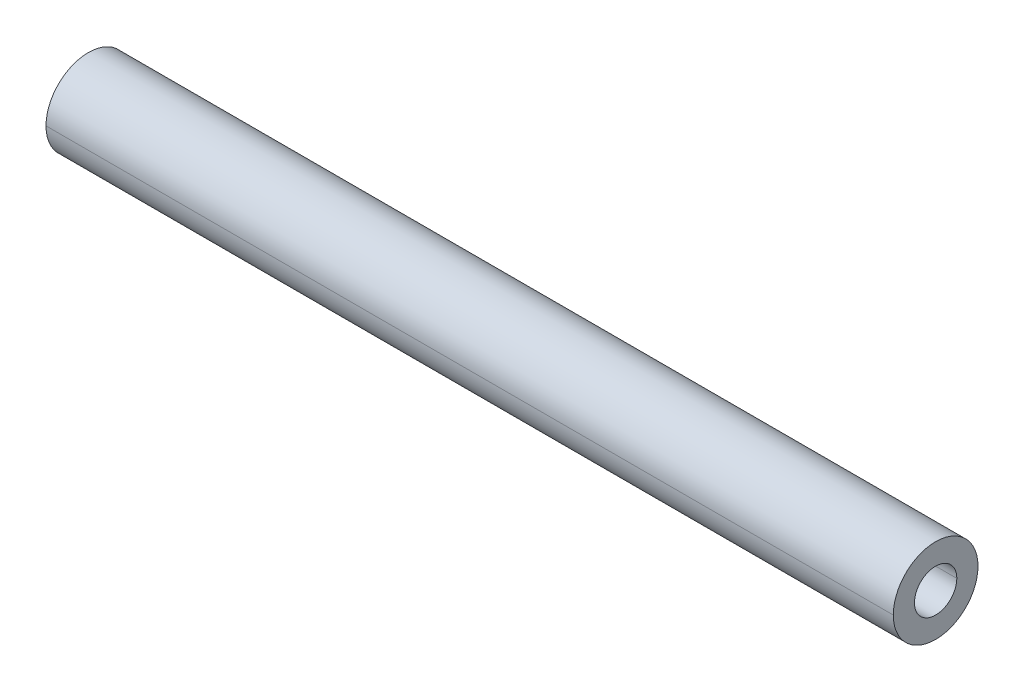
ISO-10303-21;
HEADER;
FILE_DESCRIPTION(('STEP AP214'),'2;1');
FILE_NAME('part.step','',(''),(''),'','','');
FILE_SCHEMA(('AUTOMOTIVE_DESIGN { 1 0 10303 214 1 1 1 1 }'));
ENDSEC;
DATA;
#1=APPLICATION_CONTEXT('core data for automotive mechanical design processes');
#2=APPLICATION_PROTOCOL_DEFINITION('international standard','automotive_design',2000,#1);
#3=PRODUCT_CONTEXT('',#1,'mechanical');
#4=PRODUCT('Part','Part','',(#3));
#5=PRODUCT_RELATED_PRODUCT_CATEGORY('part','',(#4));
#6=PRODUCT_DEFINITION_FORMATION('','',#4);
#7=PRODUCT_DEFINITION_CONTEXT('part definition',#1,'design');
#8=PRODUCT_DEFINITION('design','',#6,#7);
#9=PRODUCT_DEFINITION_SHAPE('','',#8);
#10=(LENGTH_UNIT() NAMED_UNIT(*) SI_UNIT(.MILLI.,.METRE.));
#11=(NAMED_UNIT(*) PLANE_ANGLE_UNIT() SI_UNIT($,.RADIAN.));
#12=(NAMED_UNIT(*) SI_UNIT($,.STERADIAN.) SOLID_ANGLE_UNIT());
#13=UNCERTAINTY_MEASURE_WITH_UNIT(LENGTH_MEASURE(1.E-05),#10,'distance_accuracy_value','');
#14=(GEOMETRIC_REPRESENTATION_CONTEXT(3) GLOBAL_UNCERTAINTY_ASSIGNED_CONTEXT((#13)) GLOBAL_UNIT_ASSIGNED_CONTEXT((#10,
#11,#12)) REPRESENTATION_CONTEXT('',''));
#15=CARTESIAN_POINT('',(0.,0.,0.));
#16=DIRECTION('',(0.,0.,1.));
#17=DIRECTION('',(1.,0.,0.));
#18=AXIS2_PLACEMENT_3D('',#15,#16,#17);
#19=CARTESIAN_POINT('',(60.,0.,0.));
#20=DIRECTION('',(-1.,0.,0.));
#21=DIRECTION('',(0.,0.,1.));
#22=AXIS2_PLACEMENT_3D('',#19,#20,#21);
#23=CYLINDRICAL_SURFACE('',#22,1.5);
#24=DIRECTION('',(-1.,0.,0.));
#25=VECTOR('',#24,1.);
#26=CARTESIAN_POINT('',(60.,0.,-1.5));
#27=LINE('',#26,#25);
#28=CARTESIAN_POINT('',(60.,0.,-1.5));
#29=VERTEX_POINT('',#28);
#30=CARTESIAN_POINT('',(0.,0.,-1.5));
#31=VERTEX_POINT('',#30);
#32=EDGE_CURVE('E97',#29,#31,#27,.T.);
#33=ORIENTED_EDGE('',*,*,#32,.F.);
#34=CARTESIAN_POINT('',(60.,0.,0.));
#35=DIRECTION('',(1.,0.,0.));
#36=DIRECTION('',(0.,0.,-1.));
#37=AXIS2_PLACEMENT_3D('',#34,#35,#36);
#38=CIRCLE('',#37,1.5);
#39=CARTESIAN_POINT('',(60.,0.,1.5));
#40=VERTEX_POINT('',#39);
#41=EDGE_CURVE('E73',#29,#40,#38,.T.);
#42=ORIENTED_EDGE('',*,*,#41,.T.);
#43=DIRECTION('',(-1.,0.,0.));
#44=VECTOR('',#43,1.);
#45=CARTESIAN_POINT('',(60.,0.,1.5));
#46=LINE('',#45,#44);
#47=CARTESIAN_POINT('',(0.,0.,1.5));
#48=VERTEX_POINT('',#47);
#49=EDGE_CURVE('E85',#40,#48,#46,.T.);
#50=ORIENTED_EDGE('',*,*,#49,.T.);
#51=CARTESIAN_POINT('',(0.,0.,0.));
#52=DIRECTION('',(1.,0.,0.));
#53=DIRECTION('',(0.,0.,-1.));
#54=AXIS2_PLACEMENT_3D('',#51,#52,#53);
#55=CIRCLE('',#54,1.5);
#56=EDGE_CURVE('E10',#31,#48,#55,.T.);
#57=ORIENTED_EDGE('',*,*,#56,.F.);
#58=EDGE_LOOP('',(#33,#42,#50,#57));
#59=FACE_BOUND('',#58,.T.);
#60=ADVANCED_FACE('F16',(#59),#23,.F.);
#61=CARTESIAN_POINT('',(60.,0.,0.));
#62=DIRECTION('',(-1.,0.,0.));
#63=DIRECTION('',(0.,0.,1.));
#64=AXIS2_PLACEMENT_3D('',#61,#62,#63);
#65=CYLINDRICAL_SURFACE('',#64,3.);
#66=DIRECTION('',(-1.,0.,0.));
#67=VECTOR('',#66,1.);
#68=CARTESIAN_POINT('',(60.,0.,-3.));
#69=LINE('',#68,#67);
#70=CARTESIAN_POINT('',(60.,0.,-3.));
#71=VERTEX_POINT('',#70);
#72=CARTESIAN_POINT('',(0.,0.,-3.));
#73=VERTEX_POINT('',#72);
#74=EDGE_CURVE('E76',#71,#73,#69,.T.);
#75=ORIENTED_EDGE('',*,*,#74,.F.);
#76=CARTESIAN_POINT('',(60.,0.,0.));
#77=DIRECTION('',(1.,0.,0.));
#78=DIRECTION('',(0.,0.,-1.));
#79=AXIS2_PLACEMENT_3D('',#76,#77,#78);
#80=CIRCLE('',#79,3.);
#81=CARTESIAN_POINT('',(60.,0.,3.));
#82=VERTEX_POINT('',#81);
#83=EDGE_CURVE('E65',#82,#71,#80,.T.);
#84=ORIENTED_EDGE('',*,*,#83,.F.);
#85=DIRECTION('',(-1.,0.,0.));
#86=VECTOR('',#85,1.);
#87=CARTESIAN_POINT('',(60.,0.,3.));
#88=LINE('',#87,#86);
#89=CARTESIAN_POINT('',(0.,0.,3.));
#90=VERTEX_POINT('',#89);
#91=EDGE_CURVE('E74',#82,#90,#88,.T.);
#92=ORIENTED_EDGE('',*,*,#91,.T.);
#93=CARTESIAN_POINT('',(0.,0.,0.));
#94=DIRECTION('',(1.,0.,0.));
#95=DIRECTION('',(0.,0.,-1.));
#96=AXIS2_PLACEMENT_3D('',#93,#94,#95);
#97=CIRCLE('',#96,3.);
#98=EDGE_CURVE('E19',#90,#73,#97,.T.);
#99=ORIENTED_EDGE('',*,*,#98,.T.);
#100=EDGE_LOOP('',(#75,#84,#92,#99));
#101=FACE_BOUND('',#100,.T.);
#102=ADVANCED_FACE('F77',(#101),#65,.T.);
#103=CARTESIAN_POINT('',(0.,0.,0.));
#104=DIRECTION('',(1.,0.,0.));
#105=DIRECTION('',(0.,1.,0.));
#106=AXIS2_PLACEMENT_3D('',#103,#104,#105);
#107=PLANE('',#106);
#108=CARTESIAN_POINT('',(0.,0.,0.));
#109=DIRECTION('',(1.,0.,0.));
#110=DIRECTION('',(0.,0.,-1.));
#111=AXIS2_PLACEMENT_3D('',#108,#109,#110);
#112=CIRCLE('',#111,1.5);
#113=EDGE_CURVE('E92',#48,#31,#112,.T.);
#114=ORIENTED_EDGE('',*,*,#113,.T.);
#115=ORIENTED_EDGE('',*,*,#56,.T.);
#116=EDGE_LOOP('',(#114,#115));
#117=FACE_BOUND('',#116,.T.);
#118=ORIENTED_EDGE('',*,*,#98,.F.);
#119=CARTESIAN_POINT('',(0.,0.,0.));
#120=DIRECTION('',(1.,0.,0.));
#121=DIRECTION('',(0.,0.,-1.));
#122=AXIS2_PLACEMENT_3D('',#119,#120,#121);
#123=CIRCLE('',#122,3.);
#124=EDGE_CURVE('E81',#73,#90,#123,.T.);
#125=ORIENTED_EDGE('',*,*,#124,.F.);
#126=EDGE_LOOP('',(#118,#125));
#127=FACE_BOUND('',#126,.T.);
#128=ADVANCED_FACE('F147',(#117,#127),#107,.F.);
#129=CARTESIAN_POINT('',(60.,0.,0.));
#130=DIRECTION('',(1.,0.,0.));
#131=DIRECTION('',(0.,1.,0.));
#132=AXIS2_PLACEMENT_3D('',#129,#130,#131);
#133=PLANE('',#132);
#134=CARTESIAN_POINT('',(60.,0.,0.));
#135=DIRECTION('',(1.,0.,0.));
#136=DIRECTION('',(0.,0.,-1.));
#137=AXIS2_PLACEMENT_3D('',#134,#135,#136);
#138=CIRCLE('',#137,1.5);
#139=EDGE_CURVE('E286',#40,#29,#138,.T.);
#140=ORIENTED_EDGE('',*,*,#139,.F.);
#141=ORIENTED_EDGE('',*,*,#41,.F.);
#142=EDGE_LOOP('',(#140,#141));
#143=FACE_BOUND('',#142,.T.);
#144=ORIENTED_EDGE('',*,*,#83,.T.);
#145=CARTESIAN_POINT('',(60.,0.,0.));
#146=DIRECTION('',(1.,0.,0.));
#147=DIRECTION('',(0.,0.,-1.));
#148=AXIS2_PLACEMENT_3D('',#145,#146,#147);
#149=CIRCLE('',#148,3.);
#150=EDGE_CURVE('E69',#71,#82,#149,.T.);
#151=ORIENTED_EDGE('',*,*,#150,.T.);
#152=EDGE_LOOP('',(#144,#151));
#153=FACE_BOUND('',#152,.T.);
#154=ADVANCED_FACE('F67',(#143,#153),#133,.T.);
#155=CARTESIAN_POINT('',(60.,0.,0.));
#156=DIRECTION('',(-1.,0.,0.));
#157=DIRECTION('',(0.,0.,1.));
#158=AXIS2_PLACEMENT_3D('',#155,#156,#157);
#159=CYLINDRICAL_SURFACE('',#158,3.);
#160=ORIENTED_EDGE('',*,*,#150,.F.);
#161=ORIENTED_EDGE('',*,*,#74,.T.);
#162=ORIENTED_EDGE('',*,*,#124,.T.);
#163=ORIENTED_EDGE('',*,*,#91,.F.);
#164=EDGE_LOOP('',(#160,#161,#162,#163));
#165=FACE_BOUND('',#164,.T.);
#166=ADVANCED_FACE('F83',(#165),#159,.T.);
#167=CARTESIAN_POINT('',(60.,0.,0.));
#168=DIRECTION('',(-1.,0.,0.));
#169=DIRECTION('',(0.,0.,1.));
#170=AXIS2_PLACEMENT_3D('',#167,#168,#169);
#171=CYLINDRICAL_SURFACE('',#170,1.5);
#172=ORIENTED_EDGE('',*,*,#139,.T.);
#173=ORIENTED_EDGE('',*,*,#32,.T.);
#174=ORIENTED_EDGE('',*,*,#113,.F.);
#175=ORIENTED_EDGE('',*,*,#49,.F.);
#176=EDGE_LOOP('',(#172,#173,#174,#175));
#177=FACE_BOUND('',#176,.T.);
#178=ADVANCED_FACE('F120',(#177),#171,.F.);
#179=CLOSED_SHELL('',(#60,#102,#128,#154,#166,#178));
#180=MANIFOLD_SOLID_BREP('B1',#179);
#181=ADVANCED_BREP_SHAPE_REPRESENTATION('',(#18,#180),#14);
#182=SHAPE_DEFINITION_REPRESENTATION(#9,#181);
ENDSEC;
END-ISO-10303-21;
